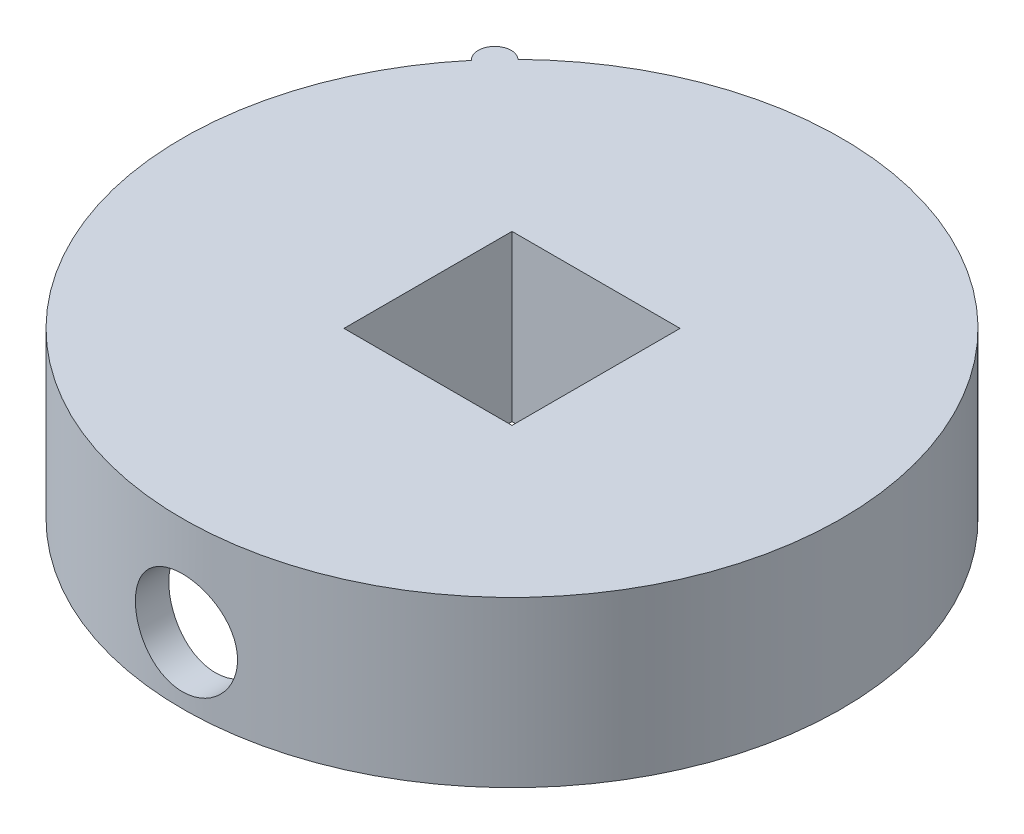
ISO-10303-21;
HEADER;
FILE_DESCRIPTION(('STEP AP214'),'2;1');
FILE_NAME('part.step','',(''),(''),'','','');
FILE_SCHEMA(('AUTOMOTIVE_DESIGN { 1 0 10303 214 1 1 1 1 }'));
ENDSEC;
DATA;
#1=APPLICATION_CONTEXT('core data for automotive mechanical design processes');
#2=APPLICATION_PROTOCOL_DEFINITION('international standard','automotive_design',2000,#1);
#3=PRODUCT_CONTEXT('',#1,'mechanical');
#4=PRODUCT('Part','Part','',(#3));
#5=PRODUCT_RELATED_PRODUCT_CATEGORY('part','',(#4));
#6=PRODUCT_DEFINITION_FORMATION('','',#4);
#7=PRODUCT_DEFINITION_CONTEXT('part definition',#1,'design');
#8=PRODUCT_DEFINITION('design','',#6,#7);
#9=PRODUCT_DEFINITION_SHAPE('','',#8);
#10=(LENGTH_UNIT() NAMED_UNIT(*) SI_UNIT(.MILLI.,.METRE.));
#11=(NAMED_UNIT(*) PLANE_ANGLE_UNIT() SI_UNIT($,.RADIAN.));
#12=(NAMED_UNIT(*) SI_UNIT($,.STERADIAN.) SOLID_ANGLE_UNIT());
#13=UNCERTAINTY_MEASURE_WITH_UNIT(LENGTH_MEASURE(1.E-05),#10,'distance_accuracy_value','');
#14=(GEOMETRIC_REPRESENTATION_CONTEXT(3) GLOBAL_UNCERTAINTY_ASSIGNED_CONTEXT((#13)) GLOBAL_UNIT_ASSIGNED_CONTEXT((#10,
#11,#12)) REPRESENTATION_CONTEXT('',''));
#15=CARTESIAN_POINT('',(0.,0.,0.));
#16=DIRECTION('',(0.,0.,1.));
#17=DIRECTION('',(1.,0.,0.));
#18=AXIS2_PLACEMENT_3D('',#15,#16,#17);
#19=CARTESIAN_POINT('',(0.,10.,0.));
#20=DIRECTION('',(0.,-1.,0.));
#21=DIRECTION('',(0.,0.,-1.));
#22=AXIS2_PLACEMENT_3D('',#19,#20,#21);
#23=CYLINDRICAL_SURFACE('',#22,20.);
#24=CARTESIAN_POINT('',(0.,10.,0.));
#25=DIRECTION('',(0.,1.,0.));
#26=DIRECTION('',(0.,0.,1.));
#27=AXIS2_PLACEMENT_3D('',#24,#25,#26);
#28=CIRCLE('',#27,20.);
#29=CARTESIAN_POINT('',(-15.3208888623795,10.,-12.8557521937308));
#30=VERTEX_POINT('',#29);
#31=CARTESIAN_POINT('',(-13.960317173332,10.,-14.3216460094491));
#32=VERTEX_POINT('',#31);
#33=EDGE_CURVE('E11',#30,#32,#28,.T.);
#34=ORIENTED_EDGE('',*,*,#33,.F.);
#35=DIRECTION('',(0.,1.,0.));
#36=VECTOR('',#35,1.);
#37=CARTESIAN_POINT('',(-15.3208888623796,-2.41380726338418,-12.8557521937307));
#38=LINE('',#37,#36);
#39=CARTESIAN_POINT('',(-15.3208888623796,0.,-12.8557521937307));
#40=VERTEX_POINT('',#39);
#41=EDGE_CURVE('E117',#40,#30,#38,.T.);
#42=ORIENTED_EDGE('',*,*,#41,.F.);
#43=CARTESIAN_POINT('',(0.,0.,0.));
#44=DIRECTION('',(0.,1.,0.));
#45=DIRECTION('',(0.,0.,1.));
#46=AXIS2_PLACEMENT_3D('',#43,#44,#45);
#47=CIRCLE('',#46,20.);
#48=CARTESIAN_POINT('',(-13.960317173332,0.,-14.3216460094491));
#49=VERTEX_POINT('',#48);
#50=EDGE_CURVE('E44',#40,#49,#47,.T.);
#51=ORIENTED_EDGE('',*,*,#50,.T.);
#52=DIRECTION('',(0.,1.,0.));
#53=VECTOR('',#52,1.);
#54=CARTESIAN_POINT('',(-13.9603171733319,-2.41380726338418,-14.3216460094492));
#55=LINE('',#54,#53);
#56=EDGE_CURVE('E58',#49,#32,#55,.T.);
#57=ORIENTED_EDGE('',*,*,#56,.T.);
#58=EDGE_LOOP('',(#34,#42,#51,#57));
#59=FACE_BOUND('',#58,.T.);
#60=CARTESIAN_POINT('',(0.,0.9,20.));
#61=CARTESIAN_POINT('',(0.173016557974578,0.900007080795432,19.9999971650391));
#62=CARTESIAN_POINT('',(0.34613178639695,0.914533455175428,19.9977314078076));
#63=CARTESIAN_POINT('',(0.687518635637837,0.972237701724927,19.9889109487694));
#64=CARTESIAN_POINT('',(0.855785454793477,1.01544302312093,19.9823521380743));
#65=CARTESIAN_POINT('',(1.18248593303596,1.1291791256332,19.9656822285072));
#66=CARTESIAN_POINT('',(1.34092709214203,1.19968875969523,19.9555738792985));
#67=CARTESIAN_POINT('',(1.64370610687182,1.36597920536802,19.9329202594809));
#68=CARTESIAN_POINT('',(1.78804581720928,1.46175668743951,19.9203753099998));
#69=CARTESIAN_POINT('',(2.05974845786461,1.67671260326108,19.8941255745019));
#70=CARTESIAN_POINT('',(2.18697707204052,1.79605986049788,19.8804128527335));
#71=CARTESIAN_POINT('',(2.4196867060257,2.05440416109371,19.85343479463));
#72=CARTESIAN_POINT('',(2.52516644076686,2.19340236474357,19.8401694847697));
#73=CARTESIAN_POINT('',(2.71191152805789,2.48801131649957,19.8155112551125));
#74=CARTESIAN_POINT('',(2.79304608511286,2.64370590555726,19.8041285915852));
#75=CARTESIAN_POINT('',(2.92796168702672,2.96671880338056,19.7846333252768));
#76=CARTESIAN_POINT('',(2.98174432506344,3.13403643448893,19.7765205320398));
#77=CARTESIAN_POINT('',(3.06001047470206,3.47412991875066,19.7645618858971));
#78=CARTESIAN_POINT('',(3.08472451807274,3.64685151766504,19.7606824776643));
#79=CARTESIAN_POINT('',(3.1048662780187,3.99403042740349,19.7575280822113));
#80=CARTESIAN_POINT('',(3.10029578872548,4.16848763124104,19.758252812916));
#81=CARTESIAN_POINT('',(3.06218643754866,4.5125521067266,19.7641941390446));
#82=CARTESIAN_POINT('',(3.02890496858939,4.68218867658666,19.7693708216034));
#83=CARTESIAN_POINT('',(2.93472161326262,5.01344040797057,19.783570384335));
#84=CARTESIAN_POINT('',(2.87381889722358,5.17505532838282,19.7925933800408));
#85=CARTESIAN_POINT('',(2.72585610559503,5.48645559505007,19.8135127113495));
#86=CARTESIAN_POINT('',(2.63868762651754,5.6361886031537,19.8254209140239));
#87=CARTESIAN_POINT('',(2.44074483457386,5.91899998169321,19.8507604280544));
#88=CARTESIAN_POINT('',(2.32996886913798,6.05207718515487,19.8641918460077));
#89=CARTESIAN_POINT('',(2.0865457846287,6.29929060689683,19.8912404778778));
#90=CARTESIAN_POINT('',(1.95367749855783,6.41320911235008,19.9048581429418));
#91=CARTESIAN_POINT('',(1.67059352836411,6.61716458384982,19.9306117241799));
#92=CARTESIAN_POINT('',(1.52037775867124,6.70720143208794,19.9427476330443));
#93=CARTESIAN_POINT('',(1.20666955981141,6.86085145308918,19.9641842572175));
#94=CARTESIAN_POINT('',(1.04316842223976,6.92444712418766,19.973483093561));
#95=CARTESIAN_POINT('',(0.707630368591965,7.02321658476251,19.9881823322231));
#96=CARTESIAN_POINT('',(0.535594070043371,7.05839242726859,19.9935830161389));
#97=CARTESIAN_POINT('',(0.18974745321463,7.09903258858386,19.999839979177));
#98=CARTESIAN_POINT('',(0.0159730895823901,7.10479609111716,20.0007420165939));
#99=CARTESIAN_POINT('',(-0.330059915144203,7.08724310983438,19.9980248327243));
#100=CARTESIAN_POINT('',(-0.5023186062509,7.06392758918426,19.9944057611877));
#101=CARTESIAN_POINT('',(-0.839519062554434,6.98912721291357,19.9830813062526));
#102=CARTESIAN_POINT('',(-1.00449408808775,6.93778880133858,19.9753971727289));
#103=CARTESIAN_POINT('',(-1.32349525981676,6.80855487063498,19.9568011840378));
#104=CARTESIAN_POINT('',(-1.4775208615223,6.73065803193059,19.9458891684944));
#105=CARTESIAN_POINT('',(-1.7715619191957,6.54982138344464,19.9219357385274));
#106=CARTESIAN_POINT('',(-1.91145985994471,6.44669262669295,19.9088785142824));
#107=CARTESIAN_POINT('',(-2.17206987835387,6.21858173575031,19.8821353568535));
#108=CARTESIAN_POINT('',(-2.29278076018428,6.09359824048571,19.8684493845514));
#109=CARTESIAN_POINT('',(-2.51268466926641,5.82399085535137,19.8418452953327));
#110=CARTESIAN_POINT('',(-2.61167667299673,5.67920210042096,19.8289350943909));
#111=CARTESIAN_POINT('',(-2.78393359428538,5.37487547615815,19.805486686096));
#112=CARTESIAN_POINT('',(-2.85719924335206,5.21533802635611,19.7949484113023));
#113=CARTESIAN_POINT('',(-2.97561529141455,4.88663129933381,19.7774949611492));
#114=CARTESIAN_POINT('',(-3.02086981632308,4.71750027657163,19.7705663828432));
#115=CARTESIAN_POINT('',(-3.08230938314147,4.37392249209178,19.7610817453396));
#116=CARTESIAN_POINT('',(-3.09849658118311,4.1994761256275,19.7585253618258));
#117=CARTESIAN_POINT('',(-3.10128813555182,3.85222422779024,19.7580872149381));
#118=CARTESIAN_POINT('',(-3.08820865954259,3.67942121854002,19.7601554912251));
#119=CARTESIAN_POINT('',(-3.03351744801726,3.33850471906413,19.7686247773595));
#120=CARTESIAN_POINT('',(-2.99190577093735,3.17039121923471,19.7750257783332));
#121=CARTESIAN_POINT('',(-2.88144589881863,2.84372354234137,19.791421373363));
#122=CARTESIAN_POINT('',(-2.81262129276619,2.68516122283937,19.801412854401));
#123=CARTESIAN_POINT('',(-2.64972096024408,2.3817828432796,19.8238671717296));
#124=CARTESIAN_POINT('',(-2.55564426248003,2.23696731226727,19.836330103077));
#125=CARTESIAN_POINT('',(-2.34376738116094,1.96358948224111,19.862483054043));
#126=CARTESIAN_POINT('',(-2.22573346513276,1.83520939110733,19.876184362017));
#127=CARTESIAN_POINT('',(-1.96978661876277,1.59996736742,19.903177261943));
#128=CARTESIAN_POINT('',(-1.8318690851942,1.49311043142968,19.9164687581527));
#129=CARTESIAN_POINT('',(-1.53910930505027,1.30338057555414,19.9412344524066));
#130=CARTESIAN_POINT('',(-1.38417199504349,1.22065289513756,19.9526974646132));
#131=CARTESIAN_POINT('',(-1.06249346622742,1.08252095182279,19.9724052696854));
#132=CARTESIAN_POINT('',(-0.895764538907991,1.02708870280286,19.9806533570105));
#133=CARTESIAN_POINT('',(-0.606929877005346,0.957540053066292,19.9911430658503));
#134=CARTESIAN_POINT('',(-0.486597179715198,0.935995962038425,19.9944471586378));
#135=CARTESIAN_POINT('',(-0.244192691603641,0.907223534809589,19.9988766112674));
#136=CARTESIAN_POINT('',(-0.122120924673141,0.899995002135659,20.000002001011));
#137=CARTESIAN_POINT('',(0.,0.9,20.));
#138=B_SPLINE_CURVE_WITH_KNOTS('',3,(#60,#61,#62,#63,#64,#65,#66,#67,#68,#69,#70,#71,#72,#73,
#74,#75,#76,#77,#78,#79,#80,#81,#82,#83,#84,#85,#86,#87,#88,#89,#90,#91,#92,#93,#94,#95,#96,#97,
#98,#99,#100,#101,#102,#103,#104,#105,#106,#107,#108,#109,#110,#111,#112,#113,#114,#115,#116,
#117,#118,#119,#120,#121,#122,#123,#124,#125,#126,#127,#128,#129,#130,#131,#132,#133,#134,#135,
#136,#137),.UNSPECIFIED.,.T.,.F.,(4,2,2,2,2,2,2,2,2,2,2,2,2,2,2,2,2,2,2,2,2,2,2,2,2,2,2,2,2,2,2,
2,2,2,2,2,2,2,4),(0.,0.518603389696483,1.03770386276341,1.55640309660684,2.07503401566504,
2.59752406878385,3.12004498524092,3.64532487300955,4.17057416109137,4.69162919625163,
5.21265230902045,5.72905244255467,6.24546808845431,6.76404496609117,7.28265815704321,
7.80681594553428,8.33097631965123,8.85548309023761,9.3799519674113,9.89907513525496,
10.4181811089692,10.9345999175123,11.4510443884596,11.9714813947096,12.4919508243877,
13.0170514007104,13.5421370450079,14.0652588749373,14.5883418995712,15.105801374666,
15.6232597899663,16.1402706366429,16.6573013724327,17.1796423654186,17.7021044795559,
18.2276494116379,18.7526543724209,19.1187071678768,19.4847549394298),.UNSPECIFIED.);
#139=CARTESIAN_POINT('',(0.,0.9,20.));
#140=VERTEX_POINT('',#139);
#141=EDGE_CURVE('E128',#140,#140,#138,.T.);
#142=ORIENTED_EDGE('',*,*,#141,.F.);
#143=EDGE_LOOP('',(#142));
#144=FACE_BOUND('',#143,.T.);
#145=ADVANCED_FACE('F40',(#59,#144),#23,.T.);
#146=CARTESIAN_POINT('',(0.,10.,0.));
#147=DIRECTION('',(0.,-1.,0.));
#148=DIRECTION('',(0.,0.,-1.));
#149=AXIS2_PLACEMENT_3D('',#146,#147,#148);
#150=CYLINDRICAL_SURFACE('',#149,18.);
#151=CARTESIAN_POINT('',(0.,0.,0.));
#152=DIRECTION('',(0.,1.,0.));
#153=DIRECTION('',(0.,0.,1.));
#154=AXIS2_PLACEMENT_3D('',#151,#152,#153);
#155=CIRCLE('',#154,18.);
#156=CARTESIAN_POINT('',(0.,0.,18.));
#157=VERTEX_POINT('',#156);
#158=EDGE_CURVE('E167',#157,#157,#155,.T.);
#159=ORIENTED_EDGE('',*,*,#158,.F.);
#160=EDGE_LOOP('',(#159));
#161=FACE_BOUND('',#160,.T.);
#162=CARTESIAN_POINT('',(0.,8.,0.));
#163=DIRECTION('',(0.,1.,0.));
#164=DIRECTION('',(0.,0.,1.));
#165=AXIS2_PLACEMENT_3D('',#162,#163,#164);
#166=CIRCLE('',#165,18.);
#167=CARTESIAN_POINT('',(0.,8.,18.));
#168=VERTEX_POINT('',#167);
#169=EDGE_CURVE('E171',#168,#168,#166,.T.);
#170=ORIENTED_EDGE('',*,*,#169,.T.);
#171=EDGE_LOOP('',(#170));
#172=FACE_BOUND('',#171,.T.);
#173=CARTESIAN_POINT('',(-3.1,4.,17.7310462184272));
#174=CARTESIAN_POINT('',(-3.09999313298625,3.82726272069094,17.7310494042664));
#175=CARTESIAN_POINT('',(-3.08551325830219,3.65443324166269,17.73359781963));
#176=CARTESIAN_POINT('',(-3.02800504284677,3.3136297172631,17.7435059787685));
#177=CARTESIAN_POINT('',(-2.98495091441744,3.14566020093493,17.7508700684992));
#178=CARTESIAN_POINT('',(-2.87164044523443,2.81955782532416,17.7695513490921));
#179=CARTESIAN_POINT('',(-2.80140750244069,2.66141664047294,17.7808651388806));
#180=CARTESIAN_POINT('',(-2.63579233362493,2.35917772393653,17.8061670210701));
#181=CARTESIAN_POINT('',(-2.54041271452993,2.21507853865303,17.8201548362166));
#182=CARTESIAN_POINT('',(-2.32614184855305,1.94348302334085,17.8493930596395));
#183=CARTESIAN_POINT('',(-2.20703766109128,1.81615581205768,17.8646541168498));
#184=CARTESIAN_POINT('',(-1.94915880252542,1.58318869594025,17.8946248323828));
#185=CARTESIAN_POINT('',(-1.8103829352717,1.47755011085444,17.9093344571066));
#186=CARTESIAN_POINT('',(-1.51600028932563,1.29032070282335,17.936657998033));
#187=CARTESIAN_POINT('',(-1.36029165213239,1.20888781717709,17.9492579257511));
#188=CARTESIAN_POINT('',(-1.03715174208675,1.07339715212286,17.9708237164532));
#189=CARTESIAN_POINT('',(-0.869721283594248,1.01933747313718,17.979789831599));
#190=CARTESIAN_POINT('',(-0.529639199316319,0.94064653169822,17.9930025721505));
#191=CARTESIAN_POINT('',(-0.35705518468448,0.91573085034474,17.9972947816215));
#192=CARTESIAN_POINT('',(-0.0101065543135215,0.89515029007298,18.0008328399529));
#193=CARTESIAN_POINT('',(0.164257931654621,0.899483294323953,18.0000790540098));
#194=CARTESIAN_POINT('',(0.507871793120614,0.9370562397458,17.9936460189792));
#195=CARTESIAN_POINT('',(0.677155759346085,0.969990051732044,17.988018933082));
#196=CARTESIAN_POINT('',(1.00775822133334,1.06334715589263,17.9725297958012));
#197=CARTESIAN_POINT('',(1.16907646161652,1.12377132911018,17.9626676086866));
#198=CARTESIAN_POINT('',(1.48007290317722,1.27069494452743,17.9397279725034));
#199=CARTESIAN_POINT('',(1.62969078748866,1.35731956202935,17.9266351452942));
#200=CARTESIAN_POINT('',(1.91238214853264,1.5540932748335,17.898687174683));
#201=CARTESIAN_POINT('',(2.04545419633083,1.66424439970646,17.8838318792866));
#202=CARTESIAN_POINT('',(2.29308650989974,1.90663949916695,17.8537823097114));
#203=CARTESIAN_POINT('',(2.40738472323858,2.03915111084635,17.838586137045));
#204=CARTESIAN_POINT('',(2.61216854846296,2.32160652946511,17.8097530244593));
#205=CARTESIAN_POINT('',(2.70265391082531,2.47155051904609,17.7961161008794));
#206=CARTESIAN_POINT('',(2.85730087370296,2.78492932747192,17.7719440497841));
#207=CARTESIAN_POINT('',(2.92142926062609,2.94838085830812,17.7614128406061));
#208=CARTESIAN_POINT('',(3.02124489556565,3.28395857625857,17.7447080955585));
#209=CARTESIAN_POINT('',(3.05693482896464,3.45608394268864,17.7385341482481));
#210=CARTESIAN_POINT('',(3.09848798719902,3.80177395904009,17.7313230529256));
#211=CARTESIAN_POINT('',(3.10472551762942,3.9752923138647,17.7302214459032));
#212=CARTESIAN_POINT('',(3.08819578605888,4.32089297696119,17.7331078649149));
#213=CARTESIAN_POINT('',(3.06542972381246,4.49297534433735,17.7370956804214));
#214=CARTESIAN_POINT('',(2.99185875873464,4.82961966631278,17.7496519386929));
#215=CARTESIAN_POINT('',(2.94124583341696,4.99422485025197,17.7581890061732));
#216=CARTESIAN_POINT('',(2.81361979825464,5.31261748550005,17.7788553503244));
#217=CARTESIAN_POINT('',(2.73660501354011,5.46640424976855,17.7909848548842));
#218=CARTESIAN_POINT('',(2.55748363807944,5.76045617285387,17.8176183967342));
#219=CARTESIAN_POINT('',(2.45513805299021,5.90057370577815,17.8321445840279));
#220=CARTESIAN_POINT('',(2.22858683964253,6.16178043077467,17.8618706165594));
#221=CARTESIAN_POINT('',(2.10437956531447,6.28286818870502,17.8770705124594));
#222=CARTESIAN_POINT('',(1.83596895921044,6.50395300395085,17.9066360445248));
#223=CARTESIAN_POINT('',(1.6915581469289,6.60369989266837,17.9209904913054));
#224=CARTESIAN_POINT('',(1.38781145578617,6.77751584823228,17.9470660891861));
#225=CARTESIAN_POINT('',(1.2284760847549,6.8515857883715,17.9587873298389));
#226=CARTESIAN_POINT('',(0.900133060857951,6.97155973486499,17.9782273472964));
#227=CARTESIAN_POINT('',(0.731173614747658,7.0175925824532,17.9859644071876));
#228=CARTESIAN_POINT('',(0.387777506000827,7.08059964069153,17.996641785183));
#229=CARTESIAN_POINT('',(0.213341327330556,7.09757641164158,17.9995825259176));
#230=CARTESIAN_POINT('',(-0.133646085689154,7.10191176659875,18.0003293291214));
#231=CARTESIAN_POINT('',(-0.306192548851938,7.08965025784471,17.9982012535989));
#232=CARTESIAN_POINT('',(-0.646729000742405,7.03668147658913,17.9891845992446));
#233=CARTESIAN_POINT('',(-0.814719019304073,6.99597439038589,17.9822960515906));
#234=CARTESIAN_POINT('',(-1.14121455109152,6.88741952012266,17.9645302874585));
#235=CARTESIAN_POINT('',(-1.29973179471327,6.81960613815113,17.9536581282528));
#236=CARTESIAN_POINT('',(-1.60319648346798,6.65880671706889,17.9291094270097));
#237=CARTESIAN_POINT('',(-1.74814321499517,6.5658193551832,17.9154327376165));
#238=CARTESIAN_POINT('',(-2.02226104621523,6.35597463562083,17.8865791500137));
#239=CARTESIAN_POINT('',(-2.1512181870935,6.23883999122012,17.8713859895924));
#240=CARTESIAN_POINT('',(-2.38777968814283,5.98460626618822,17.8413218089942));
#241=CARTESIAN_POINT('',(-2.49537903835792,5.84750251439415,17.8264508651275));
#242=CARTESIAN_POINT('',(-2.68692820643402,5.55598003634335,17.7985921888736));
#243=CARTESIAN_POINT('',(-2.77069172773889,5.40143742750927,17.7856196566342));
#244=CARTESIAN_POINT('',(-2.91093883284905,5.08031080000741,17.7632069636885));
#245=CARTESIAN_POINT('',(-2.96744928842572,4.9137388295448,17.7537633255382));
#246=CARTESIAN_POINT('',(-3.03951297941637,4.62213034763268,17.7415403224668));
#247=CARTESIAN_POINT('',(-3.06215859815304,4.49884552094047,17.7376272886697));
#248=CARTESIAN_POINT('',(-3.09240444505106,4.25038992086438,17.7323791080338));
#249=CARTESIAN_POINT('',(-3.10000497797507,4.12521918573439,17.7310439089767));
#250=CARTESIAN_POINT('',(-3.1,4.,17.7310462184272));
#251=B_SPLINE_CURVE_WITH_KNOTS('',3,(#173,#174,#175,#176,#177,#178,#179,#180,#181,#182,#183,
#184,#185,#186,#187,#188,#189,#190,#191,#192,#193,#194,#195,#196,#197,#198,#199,#200,#201,#202,
#203,#204,#205,#206,#207,#208,#209,#210,#211,#212,#213,#214,#215,#216,#217,#218,#219,#220,#221,
#222,#223,#224,#225,#226,#227,#228,#229,#230,#231,#232,#233,#234,#235,#236,#237,#238,#239,#240,
#241,#242,#243,#244,#245,#246,#247,#248,#249,#250),.UNSPECIFIED.,.T.,.F.,(4,2,2,2,2,2,2,2,2,2,2,
2,2,2,2,2,2,2,2,2,2,2,2,2,2,2,2,2,2,2,2,2,2,2,2,2,2,2,4),(0.,0.517753850761574,1.03597559993478,
1.55375220630103,2.07147515645401,2.59407326128228,3.11670315667935,3.64267180628803,
4.16860395102849,4.68935948381991,5.21007732809709,5.72528941141336,6.24051800801167,
6.75824812295139,7.27602291917712,7.80050309565845,8.32498876769148,8.85013335577677,
9.37522834969941,9.89363170722258,10.4120136213134,10.9268657713359,11.4417505883749,
11.961692000747,12.4816725787187,13.0074499206043,13.5332093786423,14.0565341726182,
14.5798128510276,15.0963294394443,15.6128426450766,16.128702386328,16.6445892388609,
17.1667678336015,17.6890687728398,18.2153463288493,18.7411039040315,19.1164370642766,
19.4917626214611),.UNSPECIFIED.);
#252=CARTESIAN_POINT('',(-3.1,4.,17.7310462184272));
#253=VERTEX_POINT('',#252);
#254=EDGE_CURVE('E125',#253,#253,#251,.T.);
#255=ORIENTED_EDGE('',*,*,#254,.T.);
#256=EDGE_LOOP('',(#255));
#257=FACE_BOUND('',#256,.T.);
#258=ADVANCED_FACE('F140',(#161,#172,#257),#150,.F.);
#259=CARTESIAN_POINT('',(0.,0.,0.));
#260=DIRECTION('',(0.,1.,0.));
#261=DIRECTION('',(0.,0.,1.));
#262=AXIS2_PLACEMENT_3D('',#259,#260,#261);
#263=PLANE('',#262);
#264=DIRECTION('',(0.,0.,-1.));
#265=VECTOR('',#264,1.);
#266=CARTESIAN_POINT('',(-7.1,0.,5.1));
#267=LINE('',#266,#265);
#268=CARTESIAN_POINT('',(-7.1,0.,7.1));
#269=VERTEX_POINT('',#268);
#270=CARTESIAN_POINT('',(-7.1,0.,-7.1));
#271=VERTEX_POINT('',#270);
#272=EDGE_CURVE('E176',#269,#271,#267,.T.);
#273=ORIENTED_EDGE('',*,*,#272,.T.);
#274=DIRECTION('',(1.,0.,0.));
#275=VECTOR('',#274,1.);
#276=CARTESIAN_POINT('',(5.1,0.,-7.1));
#277=LINE('',#276,#275);
#278=CARTESIAN_POINT('',(7.1,0.,-7.1));
#279=VERTEX_POINT('',#278);
#280=EDGE_CURVE('E178',#271,#279,#277,.T.);
#281=ORIENTED_EDGE('',*,*,#280,.T.);
#282=DIRECTION('',(0.,0.,1.));
#283=VECTOR('',#282,1.);
#284=CARTESIAN_POINT('',(7.1,0.,5.1));
#285=LINE('',#284,#283);
#286=CARTESIAN_POINT('',(7.1,0.,7.1));
#287=VERTEX_POINT('',#286);
#288=EDGE_CURVE('E183',#279,#287,#285,.T.);
#289=ORIENTED_EDGE('',*,*,#288,.T.);
#290=DIRECTION('',(-1.,0.,0.));
#291=VECTOR('',#290,1.);
#292=CARTESIAN_POINT('',(5.1,0.,7.1));
#293=LINE('',#292,#291);
#294=EDGE_CURVE('E188',#287,#269,#293,.T.);
#295=ORIENTED_EDGE('',*,*,#294,.T.);
#296=EDGE_LOOP('',(#273,#281,#289,#295));
#297=FACE_BOUND('',#296,.T.);
#298=DIRECTION('',(1.,0.,0.));
#299=VECTOR('',#298,1.);
#300=CARTESIAN_POINT('',(5.1,0.,-5.1));
#301=LINE('',#300,#299);
#302=CARTESIAN_POINT('',(-5.1,0.,-5.1));
#303=VERTEX_POINT('',#302);
#304=CARTESIAN_POINT('',(5.1,0.,-5.1));
#305=VERTEX_POINT('',#304);
#306=EDGE_CURVE('E210',#303,#305,#301,.T.);
#307=ORIENTED_EDGE('',*,*,#306,.F.);
#308=DIRECTION('',(0.,0.,-1.));
#309=VECTOR('',#308,1.);
#310=CARTESIAN_POINT('',(-5.1,0.,5.1));
#311=LINE('',#310,#309);
#312=CARTESIAN_POINT('',(-5.1,0.,5.1));
#313=VERTEX_POINT('',#312);
#314=EDGE_CURVE('E208',#313,#303,#311,.T.);
#315=ORIENTED_EDGE('',*,*,#314,.F.);
#316=DIRECTION('',(-1.,0.,0.));
#317=VECTOR('',#316,1.);
#318=CARTESIAN_POINT('',(5.1,0.,5.1));
#319=LINE('',#318,#317);
#320=CARTESIAN_POINT('',(5.1,0.,5.1));
#321=VERTEX_POINT('',#320);
#322=EDGE_CURVE('E197',#321,#313,#319,.T.);
#323=ORIENTED_EDGE('',*,*,#322,.F.);
#324=DIRECTION('',(0.,0.,1.));
#325=VECTOR('',#324,1.);
#326=CARTESIAN_POINT('',(5.1,0.,5.1));
#327=LINE('',#326,#325);
#328=EDGE_CURVE('E213',#305,#321,#327,.T.);
#329=ORIENTED_EDGE('',*,*,#328,.F.);
#330=EDGE_LOOP('',(#307,#315,#323,#329));
#331=FACE_BOUND('',#330,.T.);
#332=ADVANCED_FACE('F157',(#297,#331),#263,.F.);
#333=CARTESIAN_POINT('',(0.,10.,0.));
#334=DIRECTION('',(0.,1.,0.));
#335=DIRECTION('',(0.,0.,1.));
#336=AXIS2_PLACEMENT_3D('',#333,#334,#335);
#337=PLANE('',#336);
#338=ORIENTED_EDGE('',*,*,#33,.T.);
#339=CARTESIAN_POINT('',(-14.6406030178558,10.,-13.58869910159));
#340=DIRECTION('',(0.,1.,0.));
#341=DIRECTION('',(0.,0.,-1.));
#342=AXIS2_PLACEMENT_3D('',#339,#340,#341);
#343=CIRCLE('',#342,1.);
#344=EDGE_CURVE('E122',#32,#30,#343,.T.);
#345=ORIENTED_EDGE('',*,*,#344,.T.);
#346=EDGE_LOOP('',(#338,#345));
#347=FACE_BOUND('',#346,.T.);
#348=DIRECTION('',(0.,0.,-1.));
#349=VECTOR('',#348,1.);
#350=CARTESIAN_POINT('',(-5.1,10.,5.1));
#351=LINE('',#350,#349);
#352=CARTESIAN_POINT('',(-5.1,10.,5.1));
#353=VERTEX_POINT('',#352);
#354=CARTESIAN_POINT('',(-5.1,10.,-5.1));
#355=VERTEX_POINT('',#354);
#356=EDGE_CURVE('E193',#353,#355,#351,.T.);
#357=ORIENTED_EDGE('',*,*,#356,.T.);
#358=DIRECTION('',(1.,0.,0.));
#359=VECTOR('',#358,1.);
#360=CARTESIAN_POINT('',(5.1,10.,-5.1));
#361=LINE('',#360,#359);
#362=CARTESIAN_POINT('',(5.1,10.,-5.1));
#363=VERTEX_POINT('',#362);
#364=EDGE_CURVE('E196',#355,#363,#361,.T.);
#365=ORIENTED_EDGE('',*,*,#364,.T.);
#366=DIRECTION('',(0.,0.,1.));
#367=VECTOR('',#366,1.);
#368=CARTESIAN_POINT('',(5.1,10.,5.1));
#369=LINE('',#368,#367);
#370=CARTESIAN_POINT('',(5.1,10.,5.1));
#371=VERTEX_POINT('',#370);
#372=EDGE_CURVE('E200',#363,#371,#369,.T.);
#373=ORIENTED_EDGE('',*,*,#372,.T.);
#374=DIRECTION('',(-1.,0.,0.));
#375=VECTOR('',#374,1.);
#376=CARTESIAN_POINT('',(5.1,10.,5.1));
#377=LINE('',#376,#375);
#378=EDGE_CURVE('E204',#371,#353,#377,.T.);
#379=ORIENTED_EDGE('',*,*,#378,.T.);
#380=EDGE_LOOP('',(#357,#365,#373,#379));
#381=FACE_BOUND('',#380,.T.);
#382=ADVANCED_FACE('F162',(#347,#381),#337,.T.);
#383=ORIENTED_EDGE('',*,*,#158,.T.);
#384=EDGE_LOOP('',(#383));
#385=FACE_BOUND('',#384,.T.);
#386=ORIENTED_EDGE('',*,*,#50,.F.);
#387=CARTESIAN_POINT('',(-14.6406030178558,0.,-13.58869910159));
#388=DIRECTION('',(0.,1.,0.));
#389=DIRECTION('',(0.,0.,1.));
#390=AXIS2_PLACEMENT_3D('',#387,#388,#389);
#391=CIRCLE('',#390,1.);
#392=EDGE_CURVE('E115',#40,#49,#391,.F.);
#393=ORIENTED_EDGE('',*,*,#392,.T.);
#394=EDGE_LOOP('',(#386,#393));
#395=FACE_BOUND('',#394,.T.);
#396=ADVANCED_FACE('F113',(#385,#395),#263,.F.);
#397=CARTESIAN_POINT('',(-5.1,10.,5.1));
#398=DIRECTION('',(-1.,0.,0.));
#399=DIRECTION('',(0.,0.,1.));
#400=AXIS2_PLACEMENT_3D('',#397,#398,#399);
#401=PLANE('',#400);
#402=ORIENTED_EDGE('',*,*,#314,.T.);
#403=DIRECTION('',(0.,-1.,0.));
#404=VECTOR('',#403,1.);
#405=CARTESIAN_POINT('',(-5.1,10.,-5.1));
#406=LINE('',#405,#404);
#407=EDGE_CURVE('E207',#355,#303,#406,.T.);
#408=ORIENTED_EDGE('',*,*,#407,.F.);
#409=ORIENTED_EDGE('',*,*,#356,.F.);
#410=DIRECTION('',(0.,-1.,0.));
#411=VECTOR('',#410,1.);
#412=CARTESIAN_POINT('',(-5.1,10.,5.1));
#413=LINE('',#412,#411);
#414=EDGE_CURVE('E116',#353,#313,#413,.T.);
#415=ORIENTED_EDGE('',*,*,#414,.T.);
#416=EDGE_LOOP('',(#402,#408,#409,#415));
#417=FACE_BOUND('',#416,.T.);
#418=ADVANCED_FACE('F240',(#417),#401,.F.);
#419=CARTESIAN_POINT('',(5.1,10.,5.1));
#420=DIRECTION('',(0.,0.,1.));
#421=DIRECTION('',(1.,0.,0.));
#422=AXIS2_PLACEMENT_3D('',#419,#420,#421);
#423=PLANE('',#422);
#424=ORIENTED_EDGE('',*,*,#322,.T.);
#425=ORIENTED_EDGE('',*,*,#414,.F.);
#426=ORIENTED_EDGE('',*,*,#378,.F.);
#427=DIRECTION('',(0.,-1.,0.));
#428=VECTOR('',#427,1.);
#429=CARTESIAN_POINT('',(5.1,10.,5.1));
#430=LINE('',#429,#428);
#431=EDGE_CURVE('E220',#371,#321,#430,.T.);
#432=ORIENTED_EDGE('',*,*,#431,.T.);
#433=EDGE_LOOP('',(#424,#425,#426,#432));
#434=FACE_BOUND('',#433,.T.);
#435=ADVANCED_FACE('F242',(#434),#423,.F.);
#436=CARTESIAN_POINT('',(5.1,10.,5.1));
#437=DIRECTION('',(1.,0.,0.));
#438=DIRECTION('',(0.,0.,-1.));
#439=AXIS2_PLACEMENT_3D('',#436,#437,#438);
#440=PLANE('',#439);
#441=ORIENTED_EDGE('',*,*,#328,.T.);
#442=ORIENTED_EDGE('',*,*,#431,.F.);
#443=ORIENTED_EDGE('',*,*,#372,.F.);
#444=DIRECTION('',(0.,-1.,0.));
#445=VECTOR('',#444,1.);
#446=CARTESIAN_POINT('',(5.1,10.,-5.1));
#447=LINE('',#446,#445);
#448=EDGE_CURVE('E222',#363,#305,#447,.T.);
#449=ORIENTED_EDGE('',*,*,#448,.T.);
#450=EDGE_LOOP('',(#441,#442,#443,#449));
#451=FACE_BOUND('',#450,.T.);
#452=ADVANCED_FACE('F237',(#451),#440,.F.);
#453=CARTESIAN_POINT('',(5.1,10.,-5.1));
#454=DIRECTION('',(0.,0.,-1.));
#455=DIRECTION('',(-1.,0.,0.));
#456=AXIS2_PLACEMENT_3D('',#453,#454,#455);
#457=PLANE('',#456);
#458=ORIENTED_EDGE('',*,*,#306,.T.);
#459=ORIENTED_EDGE('',*,*,#448,.F.);
#460=ORIENTED_EDGE('',*,*,#364,.F.);
#461=ORIENTED_EDGE('',*,*,#407,.T.);
#462=EDGE_LOOP('',(#458,#459,#460,#461));
#463=FACE_BOUND('',#462,.T.);
#464=ADVANCED_FACE('F228',(#463),#457,.F.);
#465=CARTESIAN_POINT('',(0.,8.,0.));
#466=DIRECTION('',(0.,1.,0.));
#467=DIRECTION('',(0.,0.,1.));
#468=AXIS2_PLACEMENT_3D('',#465,#466,#467);
#469=PLANE('',#468);
#470=DIRECTION('',(0.,0.,-1.));
#471=VECTOR('',#470,1.);
#472=CARTESIAN_POINT('',(-7.1,8.,5.1));
#473=LINE('',#472,#471);
#474=CARTESIAN_POINT('',(-7.1,8.,7.1));
#475=VERTEX_POINT('',#474);
#476=CARTESIAN_POINT('',(-7.1,8.,-7.1));
#477=VERTEX_POINT('',#476);
#478=EDGE_CURVE('E190',#475,#477,#473,.T.);
#479=ORIENTED_EDGE('',*,*,#478,.F.);
#480=DIRECTION('',(-1.,0.,0.));
#481=VECTOR('',#480,1.);
#482=CARTESIAN_POINT('',(5.1,8.,7.1));
#483=LINE('',#482,#481);
#484=CARTESIAN_POINT('',(7.1,8.,7.1));
#485=VERTEX_POINT('',#484);
#486=EDGE_CURVE('E279',#485,#475,#483,.T.);
#487=ORIENTED_EDGE('',*,*,#486,.F.);
#488=DIRECTION('',(0.,0.,1.));
#489=VECTOR('',#488,1.);
#490=CARTESIAN_POINT('',(7.1,8.,5.1));
#491=LINE('',#490,#489);
#492=CARTESIAN_POINT('',(7.1,8.,-7.1));
#493=VERTEX_POINT('',#492);
#494=EDGE_CURVE('E282',#493,#485,#491,.T.);
#495=ORIENTED_EDGE('',*,*,#494,.F.);
#496=DIRECTION('',(1.,0.,0.));
#497=VECTOR('',#496,1.);
#498=CARTESIAN_POINT('',(5.1,8.,-7.1));
#499=LINE('',#498,#497);
#500=EDGE_CURVE('E285',#477,#493,#499,.T.);
#501=ORIENTED_EDGE('',*,*,#500,.F.);
#502=EDGE_LOOP('',(#479,#487,#495,#501));
#503=FACE_BOUND('',#502,.T.);
#504=ORIENTED_EDGE('',*,*,#169,.F.);
#505=EDGE_LOOP('',(#504));
#506=FACE_BOUND('',#505,.T.);
#507=ADVANCED_FACE('F255',(#503,#506),#469,.F.);
#508=CARTESIAN_POINT('',(-7.1,10.,5.1));
#509=DIRECTION('',(-1.,0.,0.));
#510=DIRECTION('',(0.,0.,1.));
#511=AXIS2_PLACEMENT_3D('',#508,#509,#510);
#512=PLANE('',#511);
#513=ORIENTED_EDGE('',*,*,#272,.F.);
#514=DIRECTION('',(0.,-1.,0.));
#515=VECTOR('',#514,1.);
#516=CARTESIAN_POINT('',(-7.1,10.,7.1));
#517=LINE('',#516,#515);
#518=EDGE_CURVE('E263',#475,#269,#517,.T.);
#519=ORIENTED_EDGE('',*,*,#518,.F.);
#520=ORIENTED_EDGE('',*,*,#478,.T.);
#521=DIRECTION('',(0.,-1.,0.));
#522=VECTOR('',#521,1.);
#523=CARTESIAN_POINT('',(-7.1,10.,-7.1));
#524=LINE('',#523,#522);
#525=EDGE_CURVE('E272',#477,#271,#524,.T.);
#526=ORIENTED_EDGE('',*,*,#525,.T.);
#527=EDGE_LOOP('',(#513,#519,#520,#526));
#528=FACE_BOUND('',#527,.T.);
#529=ADVANCED_FACE('F290',(#528),#512,.T.);
#530=CARTESIAN_POINT('',(5.1,10.,7.1));
#531=DIRECTION('',(0.,0.,1.));
#532=DIRECTION('',(1.,0.,0.));
#533=AXIS2_PLACEMENT_3D('',#530,#531,#532);
#534=PLANE('',#533);
#535=ORIENTED_EDGE('',*,*,#294,.F.);
#536=DIRECTION('',(0.,-1.,0.));
#537=VECTOR('',#536,1.);
#538=CARTESIAN_POINT('',(7.1,10.,7.1));
#539=LINE('',#538,#537);
#540=EDGE_CURVE('E264',#485,#287,#539,.T.);
#541=ORIENTED_EDGE('',*,*,#540,.F.);
#542=ORIENTED_EDGE('',*,*,#486,.T.);
#543=ORIENTED_EDGE('',*,*,#518,.T.);
#544=EDGE_LOOP('',(#535,#541,#542,#543));
#545=FACE_BOUND('',#544,.T.);
#546=ADVANCED_FACE('F296',(#545),#534,.T.);
#547=CARTESIAN_POINT('',(7.1,10.,5.1));
#548=DIRECTION('',(1.,0.,0.));
#549=DIRECTION('',(0.,0.,-1.));
#550=AXIS2_PLACEMENT_3D('',#547,#548,#549);
#551=PLANE('',#550);
#552=ORIENTED_EDGE('',*,*,#288,.F.);
#553=DIRECTION('',(0.,-1.,0.));
#554=VECTOR('',#553,1.);
#555=CARTESIAN_POINT('',(7.1,10.,-7.1));
#556=LINE('',#555,#554);
#557=EDGE_CURVE('E269',#493,#279,#556,.T.);
#558=ORIENTED_EDGE('',*,*,#557,.F.);
#559=ORIENTED_EDGE('',*,*,#494,.T.);
#560=ORIENTED_EDGE('',*,*,#540,.T.);
#561=EDGE_LOOP('',(#552,#558,#559,#560));
#562=FACE_BOUND('',#561,.T.);
#563=ADVANCED_FACE('F295',(#562),#551,.T.);
#564=CARTESIAN_POINT('',(5.1,10.,-7.1));
#565=DIRECTION('',(0.,0.,-1.));
#566=DIRECTION('',(-1.,0.,0.));
#567=AXIS2_PLACEMENT_3D('',#564,#565,#566);
#568=PLANE('',#567);
#569=ORIENTED_EDGE('',*,*,#280,.F.);
#570=ORIENTED_EDGE('',*,*,#525,.F.);
#571=ORIENTED_EDGE('',*,*,#500,.T.);
#572=ORIENTED_EDGE('',*,*,#557,.T.);
#573=EDGE_LOOP('',(#569,#570,#571,#572));
#574=FACE_BOUND('',#573,.T.);
#575=ADVANCED_FACE('F147',(#574),#568,.T.);
#576=CARTESIAN_POINT('',(0.,4.,20.));
#577=DIRECTION('',(0.,0.,-1.));
#578=DIRECTION('',(-1.,0.,0.));
#579=AXIS2_PLACEMENT_3D('',#576,#577,#578);
#580=CYLINDRICAL_SURFACE('',#579,3.1);
#581=ORIENTED_EDGE('',*,*,#254,.F.);
#582=EDGE_LOOP('',(#581));
#583=FACE_BOUND('',#582,.T.);
#584=ORIENTED_EDGE('',*,*,#141,.T.);
#585=EDGE_LOOP('',(#584));
#586=FACE_BOUND('',#585,.T.);
#587=ADVANCED_FACE('F143',(#583,#586),#580,.F.);
#588=CARTESIAN_POINT('',(-14.6406030178558,-2.41380726338418,-13.58869910159));
#589=DIRECTION('',(0.,1.,0.));
#590=DIRECTION('',(0.,0.,1.));
#591=AXIS2_PLACEMENT_3D('',#588,#589,#590);
#592=CYLINDRICAL_SURFACE('',#591,1.);
#593=ORIENTED_EDGE('',*,*,#392,.F.);
#594=ORIENTED_EDGE('',*,*,#41,.T.);
#595=ORIENTED_EDGE('',*,*,#344,.F.);
#596=ORIENTED_EDGE('',*,*,#56,.F.);
#597=EDGE_LOOP('',(#593,#594,#595,#596));
#598=FACE_BOUND('',#597,.T.);
#599=ADVANCED_FACE('F124',(#598),#592,.T.);
#600=CLOSED_SHELL('',(#145,#258,#332,#382,#396,#418,#435,#452,#464,#507,#529,#546,#563,#575,
#587,#599));
#601=MANIFOLD_SOLID_BREP('B2',#600);
#602=ADVANCED_BREP_SHAPE_REPRESENTATION('',(#18,#601),#14);
#603=SHAPE_DEFINITION_REPRESENTATION(#9,#602);
ENDSEC;
END-ISO-10303-21;
